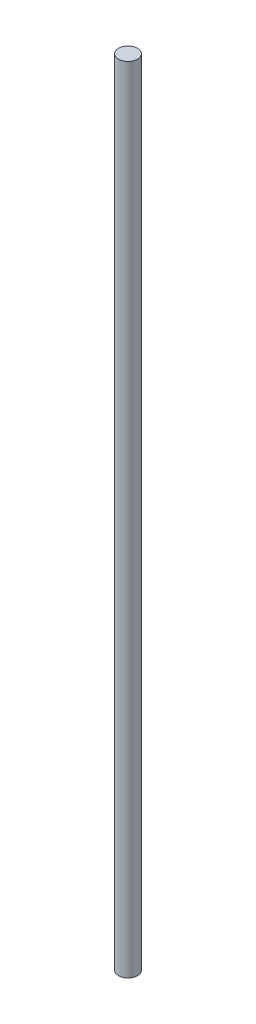
ISO-10303-21;
HEADER;
FILE_DESCRIPTION(('STEP AP214'),'2;1');
FILE_NAME('part.step','',(''),(''),'','','');
FILE_SCHEMA(('AUTOMOTIVE_DESIGN { 1 0 10303 214 1 1 1 1 }'));
ENDSEC;
DATA;
#1=APPLICATION_CONTEXT('core data for automotive mechanical design processes');
#2=APPLICATION_PROTOCOL_DEFINITION('international standard','automotive_design',2000,#1);
#3=PRODUCT_CONTEXT('',#1,'mechanical');
#4=PRODUCT('Part','Part','',(#3));
#5=PRODUCT_RELATED_PRODUCT_CATEGORY('part','',(#4));
#6=PRODUCT_DEFINITION_FORMATION('','',#4);
#7=PRODUCT_DEFINITION_CONTEXT('part definition',#1,'design');
#8=PRODUCT_DEFINITION('design','',#6,#7);
#9=PRODUCT_DEFINITION_SHAPE('','',#8);
#10=(LENGTH_UNIT() NAMED_UNIT(*) SI_UNIT(.MILLI.,.METRE.));
#11=(NAMED_UNIT(*) PLANE_ANGLE_UNIT() SI_UNIT($,.RADIAN.));
#12=(NAMED_UNIT(*) SI_UNIT($,.STERADIAN.) SOLID_ANGLE_UNIT());
#13=UNCERTAINTY_MEASURE_WITH_UNIT(LENGTH_MEASURE(1.E-05),#10,'distance_accuracy_value','');
#14=(GEOMETRIC_REPRESENTATION_CONTEXT(3) GLOBAL_UNCERTAINTY_ASSIGNED_CONTEXT((#13)) GLOBAL_UNIT_ASSIGNED_CONTEXT((#10,
#11,#12)) REPRESENTATION_CONTEXT('',''));
#15=CARTESIAN_POINT('',(0.,0.,0.));
#16=DIRECTION('',(0.,0.,1.));
#17=DIRECTION('',(1.,0.,0.));
#18=AXIS2_PLACEMENT_3D('',#15,#16,#17);
#19=CARTESIAN_POINT('',(0.,167.5,0.));
#20=DIRECTION('',(0.,-1.,0.));
#21=DIRECTION('',(0.,0.,-1.));
#22=AXIS2_PLACEMENT_3D('',#19,#20,#21);
#23=CYLINDRICAL_SURFACE('',#22,4.);
#24=CARTESIAN_POINT('',(0.,167.5,0.));
#25=DIRECTION('',(0.,-1.,0.));
#26=DIRECTION('',(0.,0.,-1.));
#27=AXIS2_PLACEMENT_3D('',#24,#25,#26);
#28=CIRCLE('',#27,4.);
#29=CARTESIAN_POINT('',(0.,167.5,-4.));
#30=VERTEX_POINT('',#29);
#31=EDGE_CURVE('E10',#30,#30,#28,.T.);
#32=ORIENTED_EDGE('',*,*,#31,.T.);
#33=EDGE_LOOP('',(#32));
#34=FACE_BOUND('',#33,.T.);
#35=CARTESIAN_POINT('',(0.,-167.5,0.));
#36=DIRECTION('',(0.,-1.,0.));
#37=DIRECTION('',(0.,0.,-1.));
#38=AXIS2_PLACEMENT_3D('',#35,#36,#37);
#39=CIRCLE('',#38,4.);
#40=CARTESIAN_POINT('',(0.,-167.5,-4.));
#41=VERTEX_POINT('',#40);
#42=EDGE_CURVE('E41',#41,#41,#39,.T.);
#43=ORIENTED_EDGE('',*,*,#42,.F.);
#44=EDGE_LOOP('',(#43));
#45=FACE_BOUND('',#44,.T.);
#46=ADVANCED_FACE('F35',(#34,#45),#23,.T.);
#47=CARTESIAN_POINT('',(4.,167.5,0.));
#48=DIRECTION('',(0.,1.,0.));
#49=DIRECTION('',(0.,0.,1.));
#50=AXIS2_PLACEMENT_3D('',#47,#48,#49);
#51=PLANE('',#50);
#52=ORIENTED_EDGE('',*,*,#31,.F.);
#53=EDGE_LOOP('',(#52));
#54=FACE_BOUND('',#53,.T.);
#55=ADVANCED_FACE('F50',(#54),#51,.T.);
#56=CARTESIAN_POINT('',(0.,-167.5,0.));
#57=DIRECTION('',(0.,-1.,0.));
#58=DIRECTION('',(0.,0.,-1.));
#59=AXIS2_PLACEMENT_3D('',#56,#57,#58);
#60=PLANE('',#59);
#61=ORIENTED_EDGE('',*,*,#42,.T.);
#62=EDGE_LOOP('',(#61));
#63=FACE_BOUND('',#62,.T.);
#64=ADVANCED_FACE('F47',(#63),#60,.T.);
#65=CLOSED_SHELL('',(#46,#55,#64));
#66=MANIFOLD_SOLID_BREP('B2',#65);
#67=ADVANCED_BREP_SHAPE_REPRESENTATION('',(#18,#66),#14);
#68=SHAPE_DEFINITION_REPRESENTATION(#9,#67);
ENDSEC;
END-ISO-10303-21;
